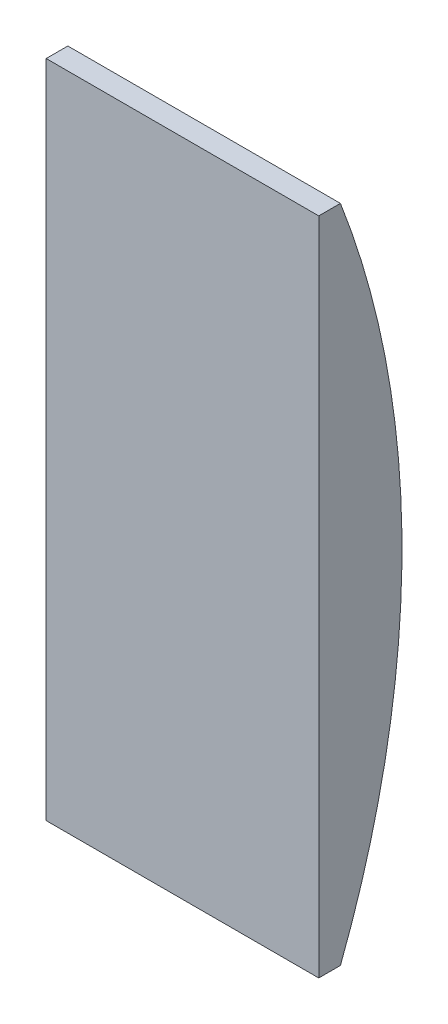
ISO-10303-21;
HEADER;
FILE_DESCRIPTION(('STEP AP214'),'2;1');
FILE_NAME('part.step','',(''),(''),'','','');
FILE_SCHEMA(('AUTOMOTIVE_DESIGN { 1 0 10303 214 1 1 1 1 }'));
ENDSEC;
DATA;
#1=APPLICATION_CONTEXT('core data for automotive mechanical design processes');
#2=APPLICATION_PROTOCOL_DEFINITION('international standard','automotive_design',2000,#1);
#3=PRODUCT_CONTEXT('',#1,'mechanical');
#4=PRODUCT('Part','Part','',(#3));
#5=PRODUCT_RELATED_PRODUCT_CATEGORY('part','',(#4));
#6=PRODUCT_DEFINITION_FORMATION('','',#4);
#7=PRODUCT_DEFINITION_CONTEXT('part definition',#1,'design');
#8=PRODUCT_DEFINITION('design','',#6,#7);
#9=PRODUCT_DEFINITION_SHAPE('','',#8);
#10=(LENGTH_UNIT() NAMED_UNIT(*) SI_UNIT(.MILLI.,.METRE.));
#11=(NAMED_UNIT(*) PLANE_ANGLE_UNIT() SI_UNIT($,.RADIAN.));
#12=(NAMED_UNIT(*) SI_UNIT($,.STERADIAN.) SOLID_ANGLE_UNIT());
#13=UNCERTAINTY_MEASURE_WITH_UNIT(LENGTH_MEASURE(1.E-05),#10,'distance_accuracy_value','');
#14=(GEOMETRIC_REPRESENTATION_CONTEXT(3) GLOBAL_UNCERTAINTY_ASSIGNED_CONTEXT((#13)) GLOBAL_UNIT_ASSIGNED_CONTEXT((#10,
#11,#12)) REPRESENTATION_CONTEXT('',''));
#15=CARTESIAN_POINT('',(0.,0.,0.));
#16=DIRECTION('',(0.,0.,1.));
#17=DIRECTION('',(1.,0.,0.));
#18=AXIS2_PLACEMENT_3D('',#15,#16,#17);
#19=CARTESIAN_POINT('',(39.1795,0.,0.));
#20=DIRECTION('',(0.,0.,-1.));
#21=DIRECTION('',(-1.,0.,0.));
#22=AXIS2_PLACEMENT_3D('',#19,#20,#21);
#23=PLANE('',#22);
#24=DIRECTION('',(0.,-1.,0.));
#25=VECTOR('',#24,1.);
#26=CARTESIAN_POINT('',(0.,0.,0.));
#27=LINE('',#26,#25);
#28=CARTESIAN_POINT('',(0.,94.869,0.));
#29=VERTEX_POINT('',#28);
#30=CARTESIAN_POINT('',(0.,0.,0.));
#31=VERTEX_POINT('',#30);
#32=EDGE_CURVE('E96',#29,#31,#27,.T.);
#33=ORIENTED_EDGE('',*,*,#32,.T.);
#34=DIRECTION('',(-1.,0.,0.));
#35=VECTOR('',#34,1.);
#36=CARTESIAN_POINT('',(39.1795,0.,0.));
#37=LINE('',#36,#35);
#38=CARTESIAN_POINT('',(39.1795,0.,0.));
#39=VERTEX_POINT('',#38);
#40=EDGE_CURVE('E11',#39,#31,#37,.T.);
#41=ORIENTED_EDGE('',*,*,#40,.F.);
#42=DIRECTION('',(0.,-1.,0.));
#43=VECTOR('',#42,1.);
#44=CARTESIAN_POINT('',(39.1795,0.,0.));
#45=LINE('',#44,#43);
#46=CARTESIAN_POINT('',(39.1795,94.869,0.));
#47=VERTEX_POINT('',#46);
#48=EDGE_CURVE('E84',#47,#39,#45,.T.);
#49=ORIENTED_EDGE('',*,*,#48,.F.);
#50=DIRECTION('',(-1.,0.,0.));
#51=VECTOR('',#50,1.);
#52=CARTESIAN_POINT('',(39.1795,94.869,0.));
#53=LINE('',#52,#51);
#54=EDGE_CURVE('E92',#47,#29,#53,.T.);
#55=ORIENTED_EDGE('',*,*,#54,.T.);
#56=EDGE_LOOP('',(#33,#41,#49,#55));
#57=FACE_BOUND('',#56,.T.);
#58=ADVANCED_FACE('F33',(#57),#23,.F.);
#59=CARTESIAN_POINT('',(39.1795,0.,0.));
#60=DIRECTION('',(0.,1.,0.));
#61=DIRECTION('',(0.,0.,1.));
#62=AXIS2_PLACEMENT_3D('',#59,#60,#61);
#63=PLANE('',#62);
#64=DIRECTION('',(0.,0.,-1.));
#65=VECTOR('',#64,1.);
#66=CARTESIAN_POINT('',(0.,0.,0.));
#67=LINE('',#66,#65);
#68=CARTESIAN_POINT('',(0.,0.,-3.11404));
#69=VERTEX_POINT('',#68);
#70=EDGE_CURVE('E88',#31,#69,#67,.T.);
#71=ORIENTED_EDGE('',*,*,#70,.T.);
#72=DIRECTION('',(-1.,0.,0.));
#73=VECTOR('',#72,1.);
#74=CARTESIAN_POINT('',(39.1795,0.,-3.11404));
#75=LINE('',#74,#73);
#76=CARTESIAN_POINT('',(39.1795,0.,-3.11404));
#77=VERTEX_POINT('',#76);
#78=EDGE_CURVE('E41',#77,#69,#75,.T.);
#79=ORIENTED_EDGE('',*,*,#78,.F.);
#80=DIRECTION('',(0.,0.,-1.));
#81=VECTOR('',#80,1.);
#82=CARTESIAN_POINT('',(39.1795,0.,0.));
#83=LINE('',#82,#81);
#84=EDGE_CURVE('E79',#39,#77,#83,.T.);
#85=ORIENTED_EDGE('',*,*,#84,.F.);
#86=ORIENTED_EDGE('',*,*,#40,.T.);
#87=EDGE_LOOP('',(#71,#79,#85,#86));
#88=FACE_BOUND('',#87,.T.);
#89=ADVANCED_FACE('F87',(#88),#63,.F.);
#90=CARTESIAN_POINT('',(39.1795,47.4345,119.62868372093));
#91=DIRECTION('',(-1.,0.,0.));
#92=DIRECTION('',(0.,0.,1.));
#93=AXIS2_PLACEMENT_3D('',#90,#91,#92);
#94=CYLINDRICAL_SURFACE('',#93,131.58954372093);
#95=CARTESIAN_POINT('',(0.,47.4345,119.62868372093));
#96=DIRECTION('',(1.,0.,0.));
#97=DIRECTION('',(0.,0.,1.));
#98=AXIS2_PLACEMENT_3D('',#95,#96,#97);
#99=CIRCLE('',#98,131.58954372093);
#100=CARTESIAN_POINT('',(0.,94.869,-3.11404));
#101=VERTEX_POINT('',#100);
#102=EDGE_CURVE('E66',#69,#101,#99,.T.);
#103=ORIENTED_EDGE('',*,*,#102,.T.);
#104=DIRECTION('',(-1.,0.,0.));
#105=VECTOR('',#104,1.);
#106=CARTESIAN_POINT('',(39.1795,94.869,-3.11404));
#107=LINE('',#106,#105);
#108=CARTESIAN_POINT('',(39.1795,94.869,-3.11404));
#109=VERTEX_POINT('',#108);
#110=EDGE_CURVE('E89',#109,#101,#107,.T.);
#111=ORIENTED_EDGE('',*,*,#110,.F.);
#112=CARTESIAN_POINT('',(39.1795,47.4345,119.62868372093));
#113=DIRECTION('',(1.,0.,0.));
#114=DIRECTION('',(0.,0.,1.));
#115=AXIS2_PLACEMENT_3D('',#112,#113,#114);
#116=CIRCLE('',#115,131.58954372093);
#117=EDGE_CURVE('E82',#77,#109,#116,.T.);
#118=ORIENTED_EDGE('',*,*,#117,.F.);
#119=ORIENTED_EDGE('',*,*,#78,.T.);
#120=EDGE_LOOP('',(#103,#111,#118,#119));
#121=FACE_BOUND('',#120,.T.);
#122=ADVANCED_FACE('F90',(#121),#94,.T.);
#123=CARTESIAN_POINT('',(39.1795,94.869,0.));
#124=DIRECTION('',(0.,-1.,0.));
#125=DIRECTION('',(0.,0.,-1.));
#126=AXIS2_PLACEMENT_3D('',#123,#124,#125);
#127=PLANE('',#126);
#128=DIRECTION('',(0.,0.,1.));
#129=VECTOR('',#128,1.);
#130=CARTESIAN_POINT('',(0.,94.869,0.));
#131=LINE('',#130,#129);
#132=EDGE_CURVE('E72',#101,#29,#131,.T.);
#133=ORIENTED_EDGE('',*,*,#132,.T.);
#134=ORIENTED_EDGE('',*,*,#54,.F.);
#135=DIRECTION('',(0.,0.,1.));
#136=VECTOR('',#135,1.);
#137=CARTESIAN_POINT('',(39.1795,94.869,0.));
#138=LINE('',#137,#136);
#139=EDGE_CURVE('E49',#109,#47,#138,.T.);
#140=ORIENTED_EDGE('',*,*,#139,.F.);
#141=ORIENTED_EDGE('',*,*,#110,.T.);
#142=EDGE_LOOP('',(#133,#134,#140,#141));
#143=FACE_BOUND('',#142,.T.);
#144=ADVANCED_FACE('F103',(#143),#127,.F.);
#145=CARTESIAN_POINT('',(39.1795,47.4345,119.62868372093));
#146=DIRECTION('',(-1.,0.,0.));
#147=DIRECTION('',(0.,0.,1.));
#148=AXIS2_PLACEMENT_3D('',#145,#146,#147);
#149=PLANE('',#148);
#150=ORIENTED_EDGE('',*,*,#48,.T.);
#151=ORIENTED_EDGE('',*,*,#84,.T.);
#152=ORIENTED_EDGE('',*,*,#117,.T.);
#153=ORIENTED_EDGE('',*,*,#139,.T.);
#154=EDGE_LOOP('',(#150,#151,#152,#153));
#155=FACE_BOUND('',#154,.T.);
#156=ADVANCED_FACE('F80',(#155),#149,.F.);
#157=CARTESIAN_POINT('',(0.,47.4345,119.62868372093));
#158=DIRECTION('',(-1.,0.,0.));
#159=DIRECTION('',(0.,0.,1.));
#160=AXIS2_PLACEMENT_3D('',#157,#158,#159);
#161=PLANE('',#160);
#162=ORIENTED_EDGE('',*,*,#32,.F.);
#163=ORIENTED_EDGE('',*,*,#132,.F.);
#164=ORIENTED_EDGE('',*,*,#102,.F.);
#165=ORIENTED_EDGE('',*,*,#70,.F.);
#166=EDGE_LOOP('',(#162,#163,#164,#165));
#167=FACE_BOUND('',#166,.T.);
#168=ADVANCED_FACE('F106',(#167),#161,.T.);
#169=CLOSED_SHELL('',(#58,#89,#122,#144,#156,#168));
#170=MANIFOLD_SOLID_BREP('B2',#169);
#171=ADVANCED_BREP_SHAPE_REPRESENTATION('',(#18,#170),#14);
#172=SHAPE_DEFINITION_REPRESENTATION(#9,#171);
ENDSEC;
END-ISO-10303-21;
